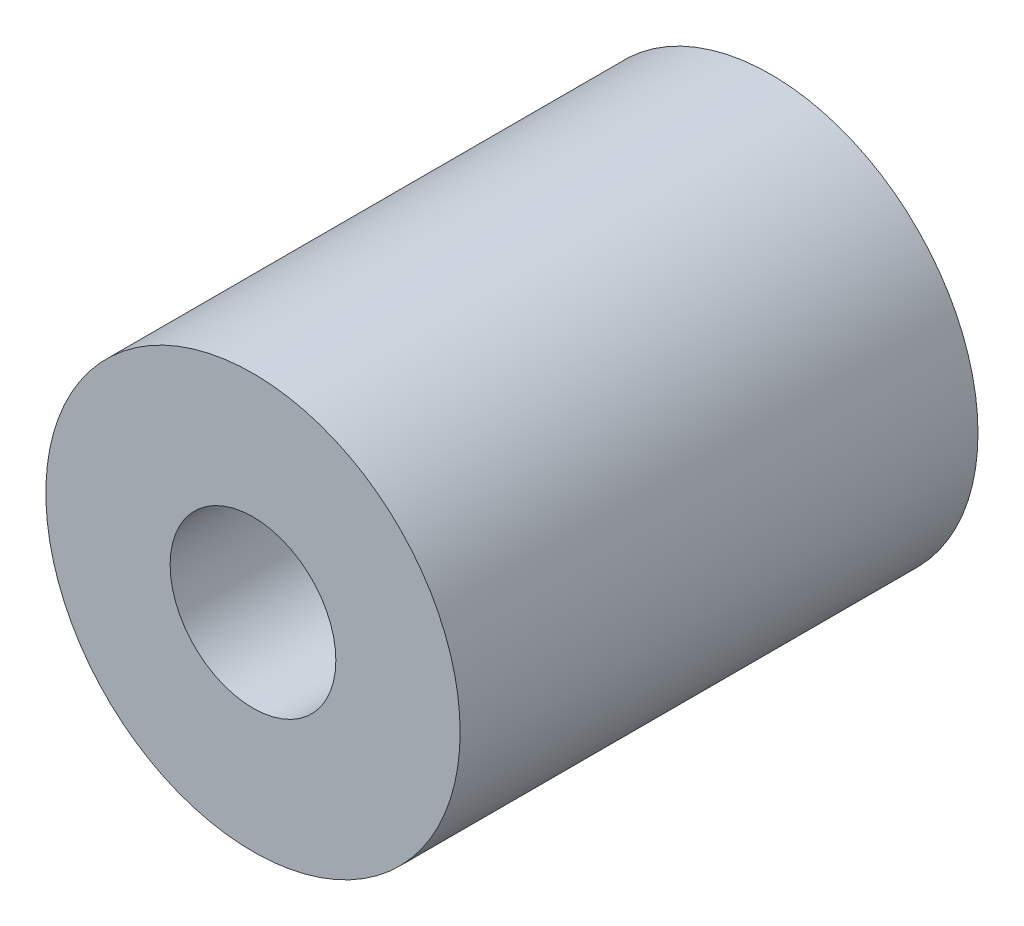
ISO-10303-21;
HEADER;
FILE_DESCRIPTION(('STEP AP214'),'2;1');
FILE_NAME('part.step','',(''),(''),'','','');
FILE_SCHEMA(('AUTOMOTIVE_DESIGN { 1 0 10303 214 1 1 1 1 }'));
ENDSEC;
DATA;
#1=APPLICATION_CONTEXT('core data for automotive mechanical design processes');
#2=APPLICATION_PROTOCOL_DEFINITION('international standard','automotive_design',2000,#1);
#3=PRODUCT_CONTEXT('',#1,'mechanical');
#4=PRODUCT('Part','Part','',(#3));
#5=PRODUCT_RELATED_PRODUCT_CATEGORY('part','',(#4));
#6=PRODUCT_DEFINITION_FORMATION('','',#4);
#7=PRODUCT_DEFINITION_CONTEXT('part definition',#1,'design');
#8=PRODUCT_DEFINITION('design','',#6,#7);
#9=PRODUCT_DEFINITION_SHAPE('','',#8);
#10=(LENGTH_UNIT() NAMED_UNIT(*) SI_UNIT(.MILLI.,.METRE.));
#11=(NAMED_UNIT(*) PLANE_ANGLE_UNIT() SI_UNIT($,.RADIAN.));
#12=(NAMED_UNIT(*) SI_UNIT($,.STERADIAN.) SOLID_ANGLE_UNIT());
#13=UNCERTAINTY_MEASURE_WITH_UNIT(LENGTH_MEASURE(1.E-05),#10,'distance_accuracy_value','');
#14=(GEOMETRIC_REPRESENTATION_CONTEXT(3) GLOBAL_UNCERTAINTY_ASSIGNED_CONTEXT((#13)) GLOBAL_UNIT_ASSIGNED_CONTEXT((#10,
#11,#12)) REPRESENTATION_CONTEXT('',''));
#15=CARTESIAN_POINT('',(0.,0.,0.));
#16=DIRECTION('',(0.,0.,1.));
#17=DIRECTION('',(1.,0.,0.));
#18=AXIS2_PLACEMENT_3D('',#15,#16,#17);
#19=CARTESIAN_POINT('',(0.,0.,25.));
#20=DIRECTION('',(0.,0.,1.));
#21=DIRECTION('',(1.,0.,0.));
#22=AXIS2_PLACEMENT_3D('',#19,#20,#21);
#23=PLANE('',#22);
#24=CARTESIAN_POINT('',(0.,0.,25.));
#25=DIRECTION('',(0.,0.,1.));
#26=DIRECTION('',(1.,0.,0.));
#27=AXIS2_PLACEMENT_3D('',#24,#25,#26);
#28=CIRCLE('',#27,10.);
#29=CARTESIAN_POINT('',(10.,0.,25.));
#30=VERTEX_POINT('',#29);
#31=EDGE_CURVE('E10',#30,#30,#28,.T.);
#32=ORIENTED_EDGE('',*,*,#31,.T.);
#33=EDGE_LOOP('',(#32));
#34=FACE_BOUND('',#33,.T.);
#35=CARTESIAN_POINT('',(0.,0.,25.));
#36=DIRECTION('',(0.,0.,1.));
#37=DIRECTION('',(1.,0.,0.));
#38=AXIS2_PLACEMENT_3D('',#35,#36,#37);
#39=CIRCLE('',#38,4.);
#40=CARTESIAN_POINT('',(4.,0.,25.));
#41=VERTEX_POINT('',#40);
#42=EDGE_CURVE('E50',#41,#41,#39,.T.);
#43=ORIENTED_EDGE('',*,*,#42,.F.);
#44=EDGE_LOOP('',(#43));
#45=FACE_BOUND('',#44,.T.);
#46=ADVANCED_FACE('F37',(#34,#45),#23,.T.);
#47=CARTESIAN_POINT('',(0.,0.,0.));
#48=DIRECTION('',(0.,0.,1.));
#49=DIRECTION('',(1.,0.,0.));
#50=AXIS2_PLACEMENT_3D('',#47,#48,#49);
#51=PLANE('',#50);
#52=CARTESIAN_POINT('',(0.,0.,0.));
#53=DIRECTION('',(0.,0.,1.));
#54=DIRECTION('',(1.,0.,0.));
#55=AXIS2_PLACEMENT_3D('',#52,#53,#54);
#56=CIRCLE('',#55,10.);
#57=CARTESIAN_POINT('',(10.,0.,0.));
#58=VERTEX_POINT('',#57);
#59=EDGE_CURVE('E41',#58,#58,#56,.T.);
#60=ORIENTED_EDGE('',*,*,#59,.F.);
#61=EDGE_LOOP('',(#60));
#62=FACE_BOUND('',#61,.T.);
#63=CARTESIAN_POINT('',(0.,0.,0.));
#64=DIRECTION('',(0.,0.,1.));
#65=DIRECTION('',(1.,0.,0.));
#66=AXIS2_PLACEMENT_3D('',#63,#64,#65);
#67=CIRCLE('',#66,4.);
#68=CARTESIAN_POINT('',(4.,0.,0.));
#69=VERTEX_POINT('',#68);
#70=EDGE_CURVE('E52',#69,#69,#67,.T.);
#71=ORIENTED_EDGE('',*,*,#70,.T.);
#72=EDGE_LOOP('',(#71));
#73=FACE_BOUND('',#72,.T.);
#74=ADVANCED_FACE('F64',(#62,#73),#51,.F.);
#75=CARTESIAN_POINT('',(0.,0.,25.));
#76=DIRECTION('',(0.,0.,-1.));
#77=DIRECTION('',(-1.,0.,0.));
#78=AXIS2_PLACEMENT_3D('',#75,#76,#77);
#79=CYLINDRICAL_SURFACE('',#78,10.);
#80=ORIENTED_EDGE('',*,*,#31,.F.);
#81=EDGE_LOOP('',(#80));
#82=FACE_BOUND('',#81,.T.);
#83=ORIENTED_EDGE('',*,*,#59,.T.);
#84=EDGE_LOOP('',(#83));
#85=FACE_BOUND('',#84,.T.);
#86=ADVANCED_FACE('F39',(#82,#85),#79,.T.);
#87=CARTESIAN_POINT('',(0.,0.,25.));
#88=DIRECTION('',(0.,0.,-1.));
#89=DIRECTION('',(-1.,0.,0.));
#90=AXIS2_PLACEMENT_3D('',#87,#88,#89);
#91=CYLINDRICAL_SURFACE('',#90,4.);
#92=ORIENTED_EDGE('',*,*,#42,.T.);
#93=EDGE_LOOP('',(#92));
#94=FACE_BOUND('',#93,.T.);
#95=ORIENTED_EDGE('',*,*,#70,.F.);
#96=EDGE_LOOP('',(#95));
#97=FACE_BOUND('',#96,.T.);
#98=ADVANCED_FACE('F60',(#94,#97),#91,.F.);
#99=CLOSED_SHELL('',(#46,#74,#86,#98));
#100=MANIFOLD_SOLID_BREP('B2',#99);
#101=ADVANCED_BREP_SHAPE_REPRESENTATION('',(#18,#100),#14);
#102=SHAPE_DEFINITION_REPRESENTATION(#9,#101);
ENDSEC;
END-ISO-10303-21;
